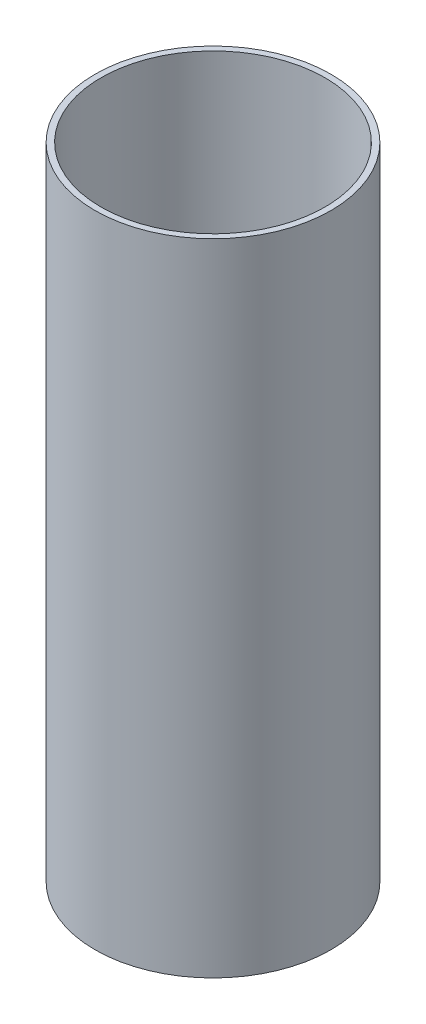
ISO-10303-21;
HEADER;
FILE_DESCRIPTION(('STEP AP214'),'2;1');
FILE_NAME('part.step','',(''),(''),'','','');
FILE_SCHEMA(('AUTOMOTIVE_DESIGN { 1 0 10303 214 1 1 1 1 }'));
ENDSEC;
DATA;
#1=APPLICATION_CONTEXT('core data for automotive mechanical design processes');
#2=APPLICATION_PROTOCOL_DEFINITION('international standard','automotive_design',2000,#1);
#3=PRODUCT_CONTEXT('',#1,'mechanical');
#4=PRODUCT('Part','Part','',(#3));
#5=PRODUCT_RELATED_PRODUCT_CATEGORY('part','',(#4));
#6=PRODUCT_DEFINITION_FORMATION('','',#4);
#7=PRODUCT_DEFINITION_CONTEXT('part definition',#1,'design');
#8=PRODUCT_DEFINITION('design','',#6,#7);
#9=PRODUCT_DEFINITION_SHAPE('','',#8);
#10=(LENGTH_UNIT() NAMED_UNIT(*) SI_UNIT(.MILLI.,.METRE.));
#11=(NAMED_UNIT(*) PLANE_ANGLE_UNIT() SI_UNIT($,.RADIAN.));
#12=(NAMED_UNIT(*) SI_UNIT($,.STERADIAN.) SOLID_ANGLE_UNIT());
#13=UNCERTAINTY_MEASURE_WITH_UNIT(LENGTH_MEASURE(1.E-05),#10,'distance_accuracy_value','');
#14=(GEOMETRIC_REPRESENTATION_CONTEXT(3) GLOBAL_UNCERTAINTY_ASSIGNED_CONTEXT((#13)) GLOBAL_UNIT_ASSIGNED_CONTEXT((#10,
#11,#12)) REPRESENTATION_CONTEXT('',''));
#15=CARTESIAN_POINT('',(0.,0.,0.));
#16=DIRECTION('',(0.,0.,1.));
#17=DIRECTION('',(1.,0.,0.));
#18=AXIS2_PLACEMENT_3D('',#15,#16,#17);
#19=CARTESIAN_POINT('',(0.,254.,0.));
#20=DIRECTION('',(0.,1.,0.));
#21=DIRECTION('',(0.,0.,1.));
#22=AXIS2_PLACEMENT_3D('',#19,#20,#21);
#23=PLANE('',#22);
#24=CARTESIAN_POINT('',(0.,254.,0.));
#25=DIRECTION('',(0.,1.,0.));
#26=DIRECTION('',(0.,0.,1.));
#27=AXIS2_PLACEMENT_3D('',#24,#25,#26);
#28=CIRCLE('',#27,93.6625);
#29=CARTESIAN_POINT('',(0.,254.,93.6625));
#30=VERTEX_POINT('',#29);
#31=EDGE_CURVE('E10',#30,#30,#28,.T.);
#32=ORIENTED_EDGE('',*,*,#31,.T.);
#33=EDGE_LOOP('',(#32));
#34=FACE_BOUND('',#33,.T.);
#35=CARTESIAN_POINT('',(0.,254.,0.));
#36=DIRECTION('',(0.,1.,0.));
#37=DIRECTION('',(0.,0.,1.));
#38=AXIS2_PLACEMENT_3D('',#35,#36,#37);
#39=CIRCLE('',#38,88.9);
#40=CARTESIAN_POINT('',(0.,254.,88.9));
#41=VERTEX_POINT('',#40);
#42=EDGE_CURVE('E43',#41,#41,#39,.T.);
#43=ORIENTED_EDGE('',*,*,#42,.F.);
#44=EDGE_LOOP('',(#43));
#45=FACE_BOUND('',#44,.T.);
#46=ADVANCED_FACE('F32',(#34,#45),#23,.T.);
#47=CARTESIAN_POINT('',(0.,-254.,0.));
#48=DIRECTION('',(0.,1.,0.));
#49=DIRECTION('',(0.,0.,1.));
#50=AXIS2_PLACEMENT_3D('',#47,#48,#49);
#51=PLANE('',#50);
#52=CARTESIAN_POINT('',(0.,-254.,0.));
#53=DIRECTION('',(0.,1.,0.));
#54=DIRECTION('',(0.,0.,1.));
#55=AXIS2_PLACEMENT_3D('',#52,#53,#54);
#56=CIRCLE('',#55,93.6625);
#57=CARTESIAN_POINT('',(0.,-254.,93.6625));
#58=VERTEX_POINT('',#57);
#59=EDGE_CURVE('E36',#58,#58,#56,.T.);
#60=ORIENTED_EDGE('',*,*,#59,.F.);
#61=EDGE_LOOP('',(#60));
#62=FACE_BOUND('',#61,.T.);
#63=CARTESIAN_POINT('',(0.,-254.,0.));
#64=DIRECTION('',(0.,1.,0.));
#65=DIRECTION('',(0.,0.,1.));
#66=AXIS2_PLACEMENT_3D('',#63,#64,#65);
#67=CIRCLE('',#66,88.9);
#68=CARTESIAN_POINT('',(0.,-254.,88.9));
#69=VERTEX_POINT('',#68);
#70=EDGE_CURVE('E45',#69,#69,#67,.T.);
#71=ORIENTED_EDGE('',*,*,#70,.T.);
#72=EDGE_LOOP('',(#71));
#73=FACE_BOUND('',#72,.T.);
#74=ADVANCED_FACE('F55',(#62,#73),#51,.F.);
#75=CARTESIAN_POINT('',(0.,254.,0.));
#76=DIRECTION('',(0.,-1.,0.));
#77=DIRECTION('',(0.,0.,-1.));
#78=AXIS2_PLACEMENT_3D('',#75,#76,#77);
#79=CYLINDRICAL_SURFACE('',#78,93.6625);
#80=ORIENTED_EDGE('',*,*,#31,.F.);
#81=EDGE_LOOP('',(#80));
#82=FACE_BOUND('',#81,.T.);
#83=ORIENTED_EDGE('',*,*,#59,.T.);
#84=EDGE_LOOP('',(#83));
#85=FACE_BOUND('',#84,.T.);
#86=ADVANCED_FACE('F34',(#82,#85),#79,.T.);
#87=CARTESIAN_POINT('',(0.,254.,0.));
#88=DIRECTION('',(0.,-1.,0.));
#89=DIRECTION('',(0.,0.,-1.));
#90=AXIS2_PLACEMENT_3D('',#87,#88,#89);
#91=CYLINDRICAL_SURFACE('',#90,88.9);
#92=ORIENTED_EDGE('',*,*,#42,.T.);
#93=EDGE_LOOP('',(#92));
#94=FACE_BOUND('',#93,.T.);
#95=ORIENTED_EDGE('',*,*,#70,.F.);
#96=EDGE_LOOP('',(#95));
#97=FACE_BOUND('',#96,.T.);
#98=ADVANCED_FACE('F51',(#94,#97),#91,.F.);
#99=CLOSED_SHELL('',(#46,#74,#86,#98));
#100=MANIFOLD_SOLID_BREP('B2',#99);
#101=ADVANCED_BREP_SHAPE_REPRESENTATION('',(#18,#100),#14);
#102=SHAPE_DEFINITION_REPRESENTATION(#9,#101);
ENDSEC;
END-ISO-10303-21;
